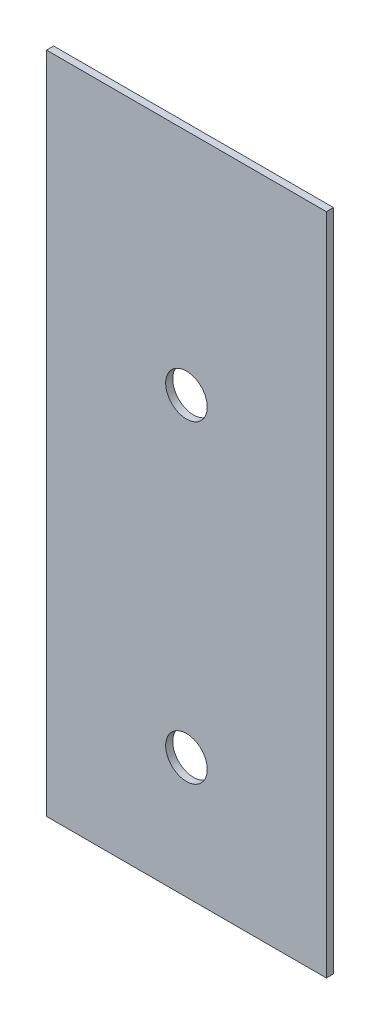
ISO-10303-21;
HEADER;
FILE_DESCRIPTION(('STEP AP214'),'2;1');
FILE_NAME('part.step','',(''),(''),'','','');
FILE_SCHEMA(('AUTOMOTIVE_DESIGN { 1 0 10303 214 1 1 1 1 }'));
ENDSEC;
DATA;
#1=APPLICATION_CONTEXT('core data for automotive mechanical design processes');
#2=APPLICATION_PROTOCOL_DEFINITION('international standard','automotive_design',2000,#1);
#3=PRODUCT_CONTEXT('',#1,'mechanical');
#4=PRODUCT('Part','Part','',(#3));
#5=PRODUCT_RELATED_PRODUCT_CATEGORY('part','',(#4));
#6=PRODUCT_DEFINITION_FORMATION('','',#4);
#7=PRODUCT_DEFINITION_CONTEXT('part definition',#1,'design');
#8=PRODUCT_DEFINITION('design','',#6,#7);
#9=PRODUCT_DEFINITION_SHAPE('','',#8);
#10=(LENGTH_UNIT() NAMED_UNIT(*) SI_UNIT(.MILLI.,.METRE.));
#11=(NAMED_UNIT(*) PLANE_ANGLE_UNIT() SI_UNIT($,.RADIAN.));
#12=(NAMED_UNIT(*) SI_UNIT($,.STERADIAN.) SOLID_ANGLE_UNIT());
#13=UNCERTAINTY_MEASURE_WITH_UNIT(LENGTH_MEASURE(1.E-05),#10,'distance_accuracy_value','');
#14=(GEOMETRIC_REPRESENTATION_CONTEXT(3) GLOBAL_UNCERTAINTY_ASSIGNED_CONTEXT((#13)) GLOBAL_UNIT_ASSIGNED_CONTEXT((#10,
#11,#12)) REPRESENTATION_CONTEXT('',''));
#15=CARTESIAN_POINT('',(0.,0.,0.));
#16=DIRECTION('',(0.,0.,1.));
#17=DIRECTION('',(1.,0.,0.));
#18=AXIS2_PLACEMENT_3D('',#15,#16,#17);
#19=CARTESIAN_POINT('',(0.,0.,0.));
#20=DIRECTION('',(0.,0.,-1.));
#21=DIRECTION('',(-1.,0.,0.));
#22=AXIS2_PLACEMENT_3D('',#19,#20,#21);
#23=PLANE('',#22);
#24=DIRECTION('',(0.,1.,0.));
#25=VECTOR('',#24,1.);
#26=CARTESIAN_POINT('',(234.95,-557.2125,2.22044604925031E-13));
#27=LINE('',#26,#25);
#28=CARTESIAN_POINT('',(234.95,-557.2125,2.22044604925031E-13));
#29=VERTEX_POINT('',#28);
#30=CARTESIAN_POINT('',(234.95,557.2125,0.));
#31=VERTEX_POINT('',#30);
#32=EDGE_CURVE('E106',#29,#31,#27,.T.);
#33=ORIENTED_EDGE('',*,*,#32,.F.);
#34=DIRECTION('',(1.,0.,0.));
#35=VECTOR('',#34,1.);
#36=CARTESIAN_POINT('',(-234.95,-557.2125,2.22044604925031E-13));
#37=LINE('',#36,#35);
#38=CARTESIAN_POINT('',(-234.95,-557.2125,2.22044604925031E-13));
#39=VERTEX_POINT('',#38);
#40=EDGE_CURVE('E77',#39,#29,#37,.T.);
#41=ORIENTED_EDGE('',*,*,#40,.F.);
#42=DIRECTION('',(0.,-1.,0.));
#43=VECTOR('',#42,1.);
#44=CARTESIAN_POINT('',(-234.95,-557.2125,2.22044604925031E-13));
#45=LINE('',#44,#43);
#46=CARTESIAN_POINT('',(-234.95,557.2125,0.));
#47=VERTEX_POINT('',#46);
#48=EDGE_CURVE('E71',#47,#39,#45,.T.);
#49=ORIENTED_EDGE('',*,*,#48,.F.);
#50=DIRECTION('',(-1.,0.,0.));
#51=VECTOR('',#50,1.);
#52=CARTESIAN_POINT('',(-234.95,557.2125,0.));
#53=LINE('',#52,#51);
#54=EDGE_CURVE('E94',#31,#47,#53,.T.);
#55=ORIENTED_EDGE('',*,*,#54,.F.);
#56=EDGE_LOOP('',(#33,#41,#49,#55));
#57=FACE_BOUND('',#56,.T.);
#58=CARTESIAN_POINT('',(0.,-354.0125,0.));
#59=DIRECTION('',(0.,0.,1.));
#60=DIRECTION('',(1.,0.,0.));
#61=AXIS2_PLACEMENT_3D('',#58,#59,#60);
#62=CIRCLE('',#61,34.925);
#63=CARTESIAN_POINT('',(34.925,-354.0125,0.));
#64=VERTEX_POINT('',#63);
#65=EDGE_CURVE('E110',#64,#64,#62,.T.);
#66=ORIENTED_EDGE('',*,*,#65,.T.);
#67=EDGE_LOOP('',(#66));
#68=FACE_BOUND('',#67,.T.);
#69=CARTESIAN_POINT('',(0.,173.0375,0.));
#70=DIRECTION('',(0.,0.,1.));
#71=DIRECTION('',(1.,0.,0.));
#72=AXIS2_PLACEMENT_3D('',#69,#70,#71);
#73=CIRCLE('',#72,34.925);
#74=CARTESIAN_POINT('',(34.925,173.0375,0.));
#75=VERTEX_POINT('',#74);
#76=EDGE_CURVE('E136',#75,#75,#73,.T.);
#77=ORIENTED_EDGE('',*,*,#76,.T.);
#78=EDGE_LOOP('',(#77));
#79=FACE_BOUND('',#78,.T.);
#80=ADVANCED_FACE('F36',(#57,#68,#79),#23,.T.);
#81=CARTESIAN_POINT('',(234.95,-557.2125,11.90625));
#82=DIRECTION('',(-1.,0.,0.));
#83=DIRECTION('',(0.,0.,1.));
#84=AXIS2_PLACEMENT_3D('',#81,#82,#83);
#85=PLANE('',#84);
#86=ORIENTED_EDGE('',*,*,#32,.T.);
#87=DIRECTION('',(0.,0.,-1.));
#88=VECTOR('',#87,1.);
#89=CARTESIAN_POINT('',(234.95,557.2125,11.9062500000001));
#90=LINE('',#89,#88);
#91=CARTESIAN_POINT('',(234.95,557.2125,11.9062500000001));
#92=VERTEX_POINT('',#91);
#93=EDGE_CURVE('E11',#92,#31,#90,.T.);
#94=ORIENTED_EDGE('',*,*,#93,.F.);
#95=DIRECTION('',(0.,1.,0.));
#96=VECTOR('',#95,1.);
#97=CARTESIAN_POINT('',(234.95,-557.2125,11.90625));
#98=LINE('',#97,#96);
#99=CARTESIAN_POINT('',(234.95,-557.2125,11.90625));
#100=VERTEX_POINT('',#99);
#101=EDGE_CURVE('E89',#100,#92,#98,.T.);
#102=ORIENTED_EDGE('',*,*,#101,.F.);
#103=DIRECTION('',(0.,0.,-1.));
#104=VECTOR('',#103,1.);
#105=CARTESIAN_POINT('',(234.95,-557.2125,11.90625));
#106=LINE('',#105,#104);
#107=EDGE_CURVE('E102',#100,#29,#106,.T.);
#108=ORIENTED_EDGE('',*,*,#107,.T.);
#109=EDGE_LOOP('',(#86,#94,#102,#108));
#110=FACE_BOUND('',#109,.T.);
#111=ADVANCED_FACE('F38',(#110),#85,.F.);
#112=CARTESIAN_POINT('',(-234.95,557.2125,11.9062500000001));
#113=DIRECTION('',(0.,-1.,0.));
#114=DIRECTION('',(0.,0.,-1.));
#115=AXIS2_PLACEMENT_3D('',#112,#113,#114);
#116=PLANE('',#115);
#117=ORIENTED_EDGE('',*,*,#54,.T.);
#118=DIRECTION('',(0.,0.,-1.));
#119=VECTOR('',#118,1.);
#120=CARTESIAN_POINT('',(-234.95,557.2125,11.9062500000001));
#121=LINE('',#120,#119);
#122=CARTESIAN_POINT('',(-234.95,557.2125,11.9062500000001));
#123=VERTEX_POINT('',#122);
#124=EDGE_CURVE('E46',#123,#47,#121,.T.);
#125=ORIENTED_EDGE('',*,*,#124,.F.);
#126=DIRECTION('',(-1.,0.,0.));
#127=VECTOR('',#126,1.);
#128=CARTESIAN_POINT('',(-234.95,557.2125,11.9062500000001));
#129=LINE('',#128,#127);
#130=EDGE_CURVE('E84',#92,#123,#129,.T.);
#131=ORIENTED_EDGE('',*,*,#130,.F.);
#132=ORIENTED_EDGE('',*,*,#93,.T.);
#133=EDGE_LOOP('',(#117,#125,#131,#132));
#134=FACE_BOUND('',#133,.T.);
#135=ADVANCED_FACE('F93',(#134),#116,.F.);
#136=CARTESIAN_POINT('',(-234.95,-557.2125,11.90625));
#137=DIRECTION('',(1.,0.,0.));
#138=DIRECTION('',(0.,0.,-1.));
#139=AXIS2_PLACEMENT_3D('',#136,#137,#138);
#140=PLANE('',#139);
#141=ORIENTED_EDGE('',*,*,#48,.T.);
#142=DIRECTION('',(0.,0.,-1.));
#143=VECTOR('',#142,1.);
#144=CARTESIAN_POINT('',(-234.95,-557.2125,11.90625));
#145=LINE('',#144,#143);
#146=CARTESIAN_POINT('',(-234.95,-557.2125,11.90625));
#147=VERTEX_POINT('',#146);
#148=EDGE_CURVE('E96',#147,#39,#145,.T.);
#149=ORIENTED_EDGE('',*,*,#148,.F.);
#150=DIRECTION('',(0.,-1.,0.));
#151=VECTOR('',#150,1.);
#152=CARTESIAN_POINT('',(-234.95,-557.2125,11.90625));
#153=LINE('',#152,#151);
#154=EDGE_CURVE('E87',#123,#147,#153,.T.);
#155=ORIENTED_EDGE('',*,*,#154,.F.);
#156=ORIENTED_EDGE('',*,*,#124,.T.);
#157=EDGE_LOOP('',(#141,#149,#155,#156));
#158=FACE_BOUND('',#157,.T.);
#159=ADVANCED_FACE('F97',(#158),#140,.F.);
#160=CARTESIAN_POINT('',(-234.95,-557.2125,11.90625));
#161=DIRECTION('',(0.,1.,0.));
#162=DIRECTION('',(0.,0.,1.));
#163=AXIS2_PLACEMENT_3D('',#160,#161,#162);
#164=PLANE('',#163);
#165=ORIENTED_EDGE('',*,*,#40,.T.);
#166=ORIENTED_EDGE('',*,*,#107,.F.);
#167=DIRECTION('',(1.,0.,0.));
#168=VECTOR('',#167,1.);
#169=CARTESIAN_POINT('',(-234.95,-557.2125,11.90625));
#170=LINE('',#169,#168);
#171=EDGE_CURVE('E54',#147,#100,#170,.T.);
#172=ORIENTED_EDGE('',*,*,#171,.F.);
#173=ORIENTED_EDGE('',*,*,#148,.T.);
#174=EDGE_LOOP('',(#165,#166,#172,#173));
#175=FACE_BOUND('',#174,.T.);
#176=ADVANCED_FACE('F121',(#175),#164,.F.);
#177=CARTESIAN_POINT('',(0.,0.,11.90625));
#178=DIRECTION('',(0.,0.,-1.));
#179=DIRECTION('',(-1.,0.,0.));
#180=AXIS2_PLACEMENT_3D('',#177,#178,#179);
#181=PLANE('',#180);
#182=CARTESIAN_POINT('',(0.,173.0375,11.9062500000001));
#183=DIRECTION('',(0.,0.,1.));
#184=DIRECTION('',(1.,0.,0.));
#185=AXIS2_PLACEMENT_3D('',#182,#183,#184);
#186=CIRCLE('',#185,34.925);
#187=CARTESIAN_POINT('',(34.925,173.0375,11.9062500000001));
#188=VERTEX_POINT('',#187);
#189=EDGE_CURVE('E140',#188,#188,#186,.T.);
#190=ORIENTED_EDGE('',*,*,#189,.F.);
#191=EDGE_LOOP('',(#190));
#192=FACE_BOUND('',#191,.T.);
#193=CARTESIAN_POINT('',(0.,-354.0125,11.90625));
#194=DIRECTION('',(0.,0.,1.));
#195=DIRECTION('',(1.,0.,0.));
#196=AXIS2_PLACEMENT_3D('',#193,#194,#195);
#197=CIRCLE('',#196,34.925);
#198=CARTESIAN_POINT('',(34.925,-354.0125,11.90625));
#199=VERTEX_POINT('',#198);
#200=EDGE_CURVE('E132',#199,#199,#197,.T.);
#201=ORIENTED_EDGE('',*,*,#200,.F.);
#202=EDGE_LOOP('',(#201));
#203=FACE_BOUND('',#202,.T.);
#204=ORIENTED_EDGE('',*,*,#101,.T.);
#205=ORIENTED_EDGE('',*,*,#130,.T.);
#206=ORIENTED_EDGE('',*,*,#154,.T.);
#207=ORIENTED_EDGE('',*,*,#171,.T.);
#208=EDGE_LOOP('',(#204,#205,#206,#207));
#209=FACE_BOUND('',#208,.T.);
#210=ADVANCED_FACE('F85',(#192,#203,#209),#181,.F.);
#211=CARTESIAN_POINT('',(0.,-354.0125,11.90625));
#212=DIRECTION('',(0.,0.,1.));
#213=DIRECTION('',(1.,0.,0.));
#214=AXIS2_PLACEMENT_3D('',#211,#212,#213);
#215=CYLINDRICAL_SURFACE('',#214,34.925);
#216=ORIENTED_EDGE('',*,*,#65,.F.);
#217=EDGE_LOOP('',(#216));
#218=FACE_BOUND('',#217,.T.);
#219=ORIENTED_EDGE('',*,*,#200,.T.);
#220=EDGE_LOOP('',(#219));
#221=FACE_BOUND('',#220,.T.);
#222=ADVANCED_FACE('F150',(#218,#221),#215,.F.);
#223=CARTESIAN_POINT('',(0.,173.0375,11.9062500000001));
#224=DIRECTION('',(0.,0.,1.));
#225=DIRECTION('',(1.,0.,0.));
#226=AXIS2_PLACEMENT_3D('',#223,#224,#225);
#227=CYLINDRICAL_SURFACE('',#226,34.925);
#228=ORIENTED_EDGE('',*,*,#76,.F.);
#229=EDGE_LOOP('',(#228));
#230=FACE_BOUND('',#229,.T.);
#231=ORIENTED_EDGE('',*,*,#189,.T.);
#232=EDGE_LOOP('',(#231));
#233=FACE_BOUND('',#232,.T.);
#234=ADVANCED_FACE('F146',(#230,#233),#227,.F.);
#235=CLOSED_SHELL('',(#80,#111,#135,#159,#176,#210,#222,#234));
#236=MANIFOLD_SOLID_BREP('B2',#235);
#237=ADVANCED_BREP_SHAPE_REPRESENTATION('',(#18,#236),#14);
#238=SHAPE_DEFINITION_REPRESENTATION(#9,#237);
ENDSEC;
END-ISO-10303-21;
